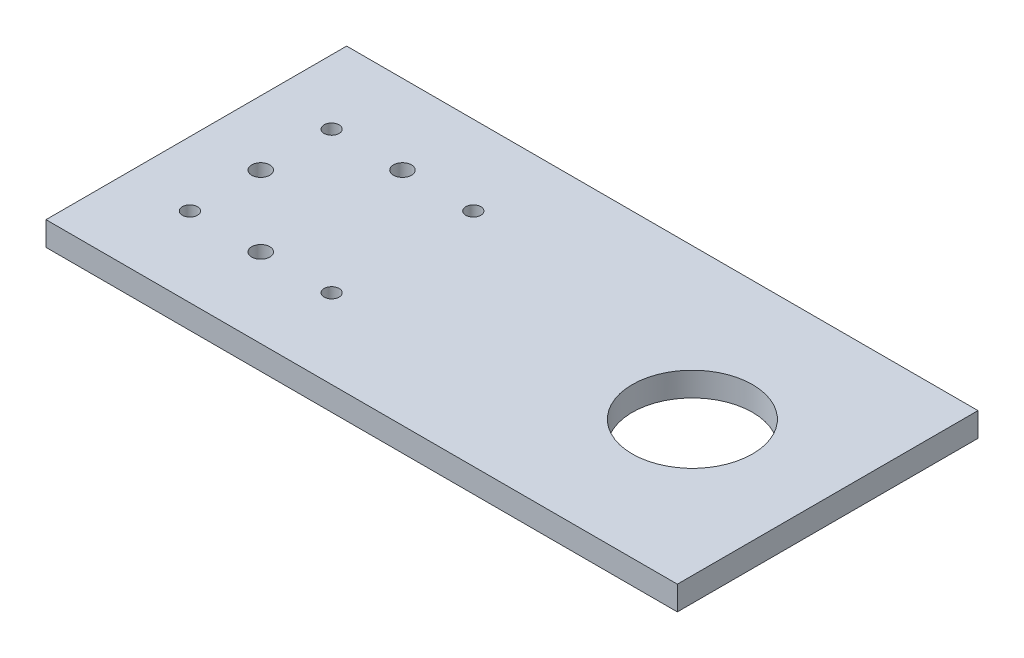
ISO-10303-21;
HEADER;
FILE_DESCRIPTION(('STEP AP214'),'2;1');
FILE_NAME('part.step','',(''),(''),'','','');
FILE_SCHEMA(('AUTOMOTIVE_DESIGN { 1 0 10303 214 1 1 1 1 }'));
ENDSEC;
DATA;
#1=APPLICATION_CONTEXT('core data for automotive mechanical design processes');
#2=APPLICATION_PROTOCOL_DEFINITION('international standard','automotive_design',2000,#1);
#3=PRODUCT_CONTEXT('',#1,'mechanical');
#4=PRODUCT('Part','Part','',(#3));
#5=PRODUCT_RELATED_PRODUCT_CATEGORY('part','',(#4));
#6=PRODUCT_DEFINITION_FORMATION('','',#4);
#7=PRODUCT_DEFINITION_CONTEXT('part definition',#1,'design');
#8=PRODUCT_DEFINITION('design','',#6,#7);
#9=PRODUCT_DEFINITION_SHAPE('','',#8);
#10=(LENGTH_UNIT() NAMED_UNIT(*) SI_UNIT(.MILLI.,.METRE.));
#11=(NAMED_UNIT(*) PLANE_ANGLE_UNIT() SI_UNIT($,.RADIAN.));
#12=(NAMED_UNIT(*) SI_UNIT($,.STERADIAN.) SOLID_ANGLE_UNIT());
#13=UNCERTAINTY_MEASURE_WITH_UNIT(LENGTH_MEASURE(1.E-05),#10,'distance_accuracy_value','');
#14=(GEOMETRIC_REPRESENTATION_CONTEXT(3) GLOBAL_UNCERTAINTY_ASSIGNED_CONTEXT((#13)) GLOBAL_UNIT_ASSIGNED_CONTEXT((#10,
#11,#12)) REPRESENTATION_CONTEXT('',''));
#15=CARTESIAN_POINT('',(0.,0.,0.));
#16=DIRECTION('',(0.,0.,1.));
#17=DIRECTION('',(1.,0.,0.));
#18=AXIS2_PLACEMENT_3D('',#15,#16,#17);
#19=CARTESIAN_POINT('',(-125.,8.,-50.));
#20=DIRECTION('',(0.,0.,1.));
#21=DIRECTION('',(1.,0.,0.));
#22=AXIS2_PLACEMENT_3D('',#19,#20,#21);
#23=PLANE('',#22);
#24=DIRECTION('',(0.,-1.,0.));
#25=VECTOR('',#24,1.);
#26=CARTESIAN_POINT('',(85.,10.,-50.));
#27=LINE('',#26,#25);
#28=CARTESIAN_POINT('',(85.,8.,-50.));
#29=VERTEX_POINT('',#28);
#30=CARTESIAN_POINT('',(85.,0.,-50.));
#31=VERTEX_POINT('',#30);
#32=EDGE_CURVE('E166',#29,#31,#27,.T.);
#33=ORIENTED_EDGE('',*,*,#32,.T.);
#34=DIRECTION('',(-1.,0.,0.));
#35=VECTOR('',#34,1.);
#36=CARTESIAN_POINT('',(-125.,0.,-50.));
#37=LINE('',#36,#35);
#38=CARTESIAN_POINT('',(-125.,0.,-50.));
#39=VERTEX_POINT('',#38);
#40=EDGE_CURVE('E85',#31,#39,#37,.T.);
#41=ORIENTED_EDGE('',*,*,#40,.T.);
#42=DIRECTION('',(0.,-1.,0.));
#43=VECTOR('',#42,1.);
#44=CARTESIAN_POINT('',(-125.,8.,-50.));
#45=LINE('',#44,#43);
#46=CARTESIAN_POINT('',(-125.,8.,-50.));
#47=VERTEX_POINT('',#46);
#48=EDGE_CURVE('E11',#47,#39,#45,.T.);
#49=ORIENTED_EDGE('',*,*,#48,.F.);
#50=DIRECTION('',(-1.,0.,0.));
#51=VECTOR('',#50,1.);
#52=CARTESIAN_POINT('',(-125.,8.,-50.));
#53=LINE('',#52,#51);
#54=EDGE_CURVE('E95',#29,#47,#53,.T.);
#55=ORIENTED_EDGE('',*,*,#54,.F.);
#56=EDGE_LOOP('',(#33,#41,#49,#55));
#57=FACE_BOUND('',#56,.T.);
#58=ADVANCED_FACE('F39',(#57),#23,.F.);
#59=CARTESIAN_POINT('',(-125.,8.,50.));
#60=DIRECTION('',(0.,0.,-1.));
#61=DIRECTION('',(-1.,0.,0.));
#62=AXIS2_PLACEMENT_3D('',#59,#60,#61);
#63=PLANE('',#62);
#64=DIRECTION('',(0.,-1.,0.));
#65=VECTOR('',#64,1.);
#66=CARTESIAN_POINT('',(85.,10.,50.));
#67=LINE('',#66,#65);
#68=CARTESIAN_POINT('',(85.,8.,50.));
#69=VERTEX_POINT('',#68);
#70=CARTESIAN_POINT('',(85.,0.,50.));
#71=VERTEX_POINT('',#70);
#72=EDGE_CURVE('E54',#69,#71,#67,.T.);
#73=ORIENTED_EDGE('',*,*,#72,.F.);
#74=DIRECTION('',(1.,0.,0.));
#75=VECTOR('',#74,1.);
#76=CARTESIAN_POINT('',(-125.,8.,50.));
#77=LINE('',#76,#75);
#78=CARTESIAN_POINT('',(-125.,8.,50.));
#79=VERTEX_POINT('',#78);
#80=EDGE_CURVE('E90',#79,#69,#77,.T.);
#81=ORIENTED_EDGE('',*,*,#80,.F.);
#82=DIRECTION('',(0.,-1.,0.));
#83=VECTOR('',#82,1.);
#84=CARTESIAN_POINT('',(-125.,8.,50.));
#85=LINE('',#84,#83);
#86=CARTESIAN_POINT('',(-125.,0.,50.));
#87=VERTEX_POINT('',#86);
#88=EDGE_CURVE('E47',#79,#87,#85,.T.);
#89=ORIENTED_EDGE('',*,*,#88,.T.);
#90=DIRECTION('',(1.,0.,0.));
#91=VECTOR('',#90,1.);
#92=CARTESIAN_POINT('',(-125.,0.,50.));
#93=LINE('',#92,#91);
#94=EDGE_CURVE('E84',#87,#71,#93,.T.);
#95=ORIENTED_EDGE('',*,*,#94,.T.);
#96=EDGE_LOOP('',(#73,#81,#89,#95));
#97=FACE_BOUND('',#96,.T.);
#98=ADVANCED_FACE('F89',(#97),#63,.F.);
#99=CARTESIAN_POINT('',(0.,8.,0.));
#100=DIRECTION('',(0.,1.,0.));
#101=DIRECTION('',(0.,0.,1.));
#102=AXIS2_PLACEMENT_3D('',#99,#100,#101);
#103=PLANE('',#102);
#104=CARTESIAN_POINT('',(40.,8.,0.));
#105=DIRECTION('',(0.,1.,0.));
#106=DIRECTION('',(0.,0.,1.));
#107=AXIS2_PLACEMENT_3D('',#104,#105,#106);
#108=CIRCLE('',#107,20.);
#109=CARTESIAN_POINT('',(40.,8.,20.));
#110=VERTEX_POINT('',#109);
#111=EDGE_CURVE('E174',#110,#110,#108,.F.);
#112=ORIENTED_EDGE('',*,*,#111,.T.);
#113=EDGE_LOOP('',(#112));
#114=FACE_BOUND('',#113,.T.);
#115=CARTESIAN_POINT('',(-80.,8.,23.57));
#116=DIRECTION('',(0.,1.,0.));
#117=DIRECTION('',(0.,0.,1.));
#118=AXIS2_PLACEMENT_3D('',#115,#116,#117);
#119=CIRCLE('',#118,3.00000000000001);
#120=CARTESIAN_POINT('',(-80.,8.,26.57));
#121=VERTEX_POINT('',#120);
#122=EDGE_CURVE('E153',#121,#121,#119,.T.);
#123=ORIENTED_EDGE('',*,*,#122,.F.);
#124=EDGE_LOOP('',(#123));
#125=FACE_BOUND('',#124,.T.);
#126=CARTESIAN_POINT('',(-80.,8.,-23.57));
#127=DIRECTION('',(0.,1.,0.));
#128=DIRECTION('',(0.,0.,1.));
#129=AXIS2_PLACEMENT_3D('',#126,#127,#128);
#130=CIRCLE('',#129,3.00000000000001);
#131=CARTESIAN_POINT('',(-80.,8.,-20.57));
#132=VERTEX_POINT('',#131);
#133=EDGE_CURVE('E149',#132,#132,#130,.T.);
#134=ORIENTED_EDGE('',*,*,#133,.F.);
#135=EDGE_LOOP('',(#134));
#136=FACE_BOUND('',#135,.T.);
#137=CARTESIAN_POINT('',(-103.57,8.,0.));
#138=DIRECTION('',(0.,1.,0.));
#139=DIRECTION('',(0.,0.,1.));
#140=AXIS2_PLACEMENT_3D('',#137,#138,#139);
#141=CIRCLE('',#140,3.00000000000001);
#142=CARTESIAN_POINT('',(-103.57,8.,3.));
#143=VERTEX_POINT('',#142);
#144=EDGE_CURVE('E139',#143,#143,#141,.T.);
#145=ORIENTED_EDGE('',*,*,#144,.F.);
#146=EDGE_LOOP('',(#145));
#147=FACE_BOUND('',#146,.T.);
#148=CARTESIAN_POINT('',(-103.57,8.,23.57));
#149=DIRECTION('',(0.,1.,0.));
#150=DIRECTION('',(0.,0.,1.));
#151=AXIS2_PLACEMENT_3D('',#148,#149,#150);
#152=CIRCLE('',#151,2.49999999999999);
#153=CARTESIAN_POINT('',(-103.57,8.,26.07));
#154=VERTEX_POINT('',#153);
#155=EDGE_CURVE('E115',#154,#154,#152,.T.);
#156=ORIENTED_EDGE('',*,*,#155,.F.);
#157=EDGE_LOOP('',(#156));
#158=FACE_BOUND('',#157,.T.);
#159=CARTESIAN_POINT('',(-56.43,8.,23.57));
#160=DIRECTION('',(0.,1.,0.));
#161=DIRECTION('',(0.,0.,1.));
#162=AXIS2_PLACEMENT_3D('',#159,#160,#161);
#163=CIRCLE('',#162,2.5);
#164=CARTESIAN_POINT('',(-56.43,8.,26.07));
#165=VERTEX_POINT('',#164);
#166=EDGE_CURVE('E125',#165,#165,#163,.T.);
#167=ORIENTED_EDGE('',*,*,#166,.F.);
#168=EDGE_LOOP('',(#167));
#169=FACE_BOUND('',#168,.T.);
#170=CARTESIAN_POINT('',(-56.43,8.,-23.57));
#171=DIRECTION('',(0.,1.,0.));
#172=DIRECTION('',(0.,0.,1.));
#173=AXIS2_PLACEMENT_3D('',#170,#171,#172);
#174=CIRCLE('',#173,2.5);
#175=CARTESIAN_POINT('',(-56.43,8.,-21.07));
#176=VERTEX_POINT('',#175);
#177=EDGE_CURVE('E114',#176,#176,#174,.T.);
#178=ORIENTED_EDGE('',*,*,#177,.F.);
#179=EDGE_LOOP('',(#178));
#180=FACE_BOUND('',#179,.T.);
#181=CARTESIAN_POINT('',(-103.57,8.,-23.57));
#182=DIRECTION('',(0.,1.,0.));
#183=DIRECTION('',(0.,0.,1.));
#184=AXIS2_PLACEMENT_3D('',#181,#182,#183);
#185=CIRCLE('',#184,2.49999999999999);
#186=CARTESIAN_POINT('',(-103.57,8.,-21.07));
#187=VERTEX_POINT('',#186);
#188=EDGE_CURVE('E110',#187,#187,#185,.T.);
#189=ORIENTED_EDGE('',*,*,#188,.F.);
#190=EDGE_LOOP('',(#189));
#191=FACE_BOUND('',#190,.T.);
#192=ORIENTED_EDGE('',*,*,#80,.T.);
#193=DIRECTION('',(0.,0.,-1.));
#194=VECTOR('',#193,1.);
#195=CARTESIAN_POINT('',(85.,8.,0.));
#196=LINE('',#195,#194);
#197=EDGE_CURVE('E148',#69,#29,#196,.T.);
#198=ORIENTED_EDGE('',*,*,#197,.T.);
#199=ORIENTED_EDGE('',*,*,#54,.T.);
#200=DIRECTION('',(0.,0.,1.));
#201=VECTOR('',#200,1.);
#202=CARTESIAN_POINT('',(-125.,8.,-50.));
#203=LINE('',#202,#201);
#204=EDGE_CURVE('E63',#47,#79,#203,.T.);
#205=ORIENTED_EDGE('',*,*,#204,.T.);
#206=EDGE_LOOP('',(#192,#198,#199,#205));
#207=FACE_BOUND('',#206,.T.);
#208=ADVANCED_FACE('F188',(#114,#125,#136,#147,#158,#169,#180,#191,#207),#103,.T.);
#209=CARTESIAN_POINT('',(0.,0.,0.));
#210=DIRECTION('',(0.,1.,0.));
#211=DIRECTION('',(0.,0.,1.));
#212=AXIS2_PLACEMENT_3D('',#209,#210,#211);
#213=PLANE('',#212);
#214=CARTESIAN_POINT('',(40.,0.,0.));
#215=DIRECTION('',(0.,-1.,0.));
#216=DIRECTION('',(0.,0.,-1.));
#217=AXIS2_PLACEMENT_3D('',#214,#215,#216);
#218=CIRCLE('',#217,20.);
#219=CARTESIAN_POINT('',(40.,0.,-20.));
#220=VERTEX_POINT('',#219);
#221=EDGE_CURVE('E178',#220,#220,#218,.T.);
#222=ORIENTED_EDGE('',*,*,#221,.F.);
#223=EDGE_LOOP('',(#222));
#224=FACE_BOUND('',#223,.T.);
#225=CARTESIAN_POINT('',(-103.57,0.,-23.57));
#226=DIRECTION('',(0.,1.,0.));
#227=DIRECTION('',(0.,0.,1.));
#228=AXIS2_PLACEMENT_3D('',#225,#226,#227);
#229=CIRCLE('',#228,2.49999999999999);
#230=CARTESIAN_POINT('',(-103.57,0.,-21.07));
#231=VERTEX_POINT('',#230);
#232=EDGE_CURVE('E102',#231,#231,#229,.F.);
#233=ORIENTED_EDGE('',*,*,#232,.F.);
#234=EDGE_LOOP('',(#233));
#235=FACE_BOUND('',#234,.T.);
#236=CARTESIAN_POINT('',(-56.43,0.,-23.57));
#237=DIRECTION('',(0.,1.,0.));
#238=DIRECTION('',(0.,0.,1.));
#239=AXIS2_PLACEMENT_3D('',#236,#237,#238);
#240=CIRCLE('',#239,2.5);
#241=CARTESIAN_POINT('',(-56.43,0.,-21.07));
#242=VERTEX_POINT('',#241);
#243=EDGE_CURVE('E129',#242,#242,#240,.F.);
#244=ORIENTED_EDGE('',*,*,#243,.F.);
#245=EDGE_LOOP('',(#244));
#246=FACE_BOUND('',#245,.T.);
#247=CARTESIAN_POINT('',(-56.43,0.,23.57));
#248=DIRECTION('',(0.,1.,0.));
#249=DIRECTION('',(0.,0.,1.));
#250=AXIS2_PLACEMENT_3D('',#247,#248,#249);
#251=CIRCLE('',#250,2.5);
#252=CARTESIAN_POINT('',(-56.43,0.,26.07));
#253=VERTEX_POINT('',#252);
#254=EDGE_CURVE('E119',#253,#253,#251,.F.);
#255=ORIENTED_EDGE('',*,*,#254,.F.);
#256=EDGE_LOOP('',(#255));
#257=FACE_BOUND('',#256,.T.);
#258=CARTESIAN_POINT('',(-103.57,0.,23.57));
#259=DIRECTION('',(0.,1.,0.));
#260=DIRECTION('',(0.,0.,1.));
#261=AXIS2_PLACEMENT_3D('',#258,#259,#260);
#262=CIRCLE('',#261,2.49999999999999);
#263=CARTESIAN_POINT('',(-103.57,0.,26.07));
#264=VERTEX_POINT('',#263);
#265=EDGE_CURVE('E120',#264,#264,#262,.F.);
#266=ORIENTED_EDGE('',*,*,#265,.F.);
#267=EDGE_LOOP('',(#266));
#268=FACE_BOUND('',#267,.T.);
#269=CARTESIAN_POINT('',(-103.57,0.,0.));
#270=DIRECTION('',(0.,1.,0.));
#271=DIRECTION('',(0.,0.,1.));
#272=AXIS2_PLACEMENT_3D('',#269,#270,#271);
#273=CIRCLE('',#272,3.00000000000001);
#274=CARTESIAN_POINT('',(-103.57,0.,3.));
#275=VERTEX_POINT('',#274);
#276=EDGE_CURVE('E144',#275,#275,#273,.F.);
#277=ORIENTED_EDGE('',*,*,#276,.F.);
#278=EDGE_LOOP('',(#277));
#279=FACE_BOUND('',#278,.T.);
#280=CARTESIAN_POINT('',(-80.,0.,-23.57));
#281=DIRECTION('',(0.,1.,0.));
#282=DIRECTION('',(0.,0.,1.));
#283=AXIS2_PLACEMENT_3D('',#280,#281,#282);
#284=CIRCLE('',#283,3.00000000000001);
#285=CARTESIAN_POINT('',(-80.,0.,-20.57));
#286=VERTEX_POINT('',#285);
#287=EDGE_CURVE('E143',#286,#286,#284,.F.);
#288=ORIENTED_EDGE('',*,*,#287,.F.);
#289=EDGE_LOOP('',(#288));
#290=FACE_BOUND('',#289,.T.);
#291=CARTESIAN_POINT('',(-80.,0.,23.57));
#292=DIRECTION('',(0.,1.,0.));
#293=DIRECTION('',(0.,0.,1.));
#294=AXIS2_PLACEMENT_3D('',#291,#292,#293);
#295=CIRCLE('',#294,3.00000000000001);
#296=CARTESIAN_POINT('',(-80.,0.,26.57));
#297=VERTEX_POINT('',#296);
#298=EDGE_CURVE('E124',#297,#297,#295,.F.);
#299=ORIENTED_EDGE('',*,*,#298,.F.);
#300=EDGE_LOOP('',(#299));
#301=FACE_BOUND('',#300,.T.);
#302=DIRECTION('',(0.,0.,1.));
#303=VECTOR('',#302,1.);
#304=CARTESIAN_POINT('',(85.,0.,-50.));
#305=LINE('',#304,#303);
#306=EDGE_CURVE('E93',#31,#71,#305,.T.);
#307=ORIENTED_EDGE('',*,*,#306,.T.);
#308=ORIENTED_EDGE('',*,*,#94,.F.);
#309=DIRECTION('',(0.,0.,1.));
#310=VECTOR('',#309,1.);
#311=CARTESIAN_POINT('',(-125.,0.,-50.));
#312=LINE('',#311,#310);
#313=EDGE_CURVE('E75',#39,#87,#312,.T.);
#314=ORIENTED_EDGE('',*,*,#313,.F.);
#315=ORIENTED_EDGE('',*,*,#40,.F.);
#316=EDGE_LOOP('',(#307,#308,#314,#315));
#317=FACE_BOUND('',#316,.T.);
#318=ADVANCED_FACE('F92',(#224,#235,#246,#257,#268,#279,#290,#301,#317),#213,.F.);
#319=CARTESIAN_POINT('',(-125.,8.,-50.));
#320=DIRECTION('',(1.,0.,0.));
#321=DIRECTION('',(0.,0.,-1.));
#322=AXIS2_PLACEMENT_3D('',#319,#320,#321);
#323=PLANE('',#322);
#324=ORIENTED_EDGE('',*,*,#313,.T.);
#325=ORIENTED_EDGE('',*,*,#88,.F.);
#326=ORIENTED_EDGE('',*,*,#204,.F.);
#327=ORIENTED_EDGE('',*,*,#48,.T.);
#328=EDGE_LOOP('',(#324,#325,#326,#327));
#329=FACE_BOUND('',#328,.T.);
#330=ADVANCED_FACE('F77',(#329),#323,.F.);
#331=CARTESIAN_POINT('',(-103.57,-7.07106781186548,-23.57));
#332=DIRECTION('',(0.,1.,0.));
#333=DIRECTION('',(0.,0.,1.));
#334=AXIS2_PLACEMENT_3D('',#331,#332,#333);
#335=CYLINDRICAL_SURFACE('',#334,2.49999999999999);
#336=ORIENTED_EDGE('',*,*,#232,.T.);
#337=EDGE_LOOP('',(#336));
#338=FACE_BOUND('',#337,.T.);
#339=ORIENTED_EDGE('',*,*,#188,.T.);
#340=EDGE_LOOP('',(#339));
#341=FACE_BOUND('',#340,.T.);
#342=ADVANCED_FACE('F242',(#338,#341),#335,.F.);
#343=CARTESIAN_POINT('',(-56.43,-7.07106781186548,-23.57));
#344=DIRECTION('',(0.,1.,0.));
#345=DIRECTION('',(0.,0.,1.));
#346=AXIS2_PLACEMENT_3D('',#343,#344,#345);
#347=CYLINDRICAL_SURFACE('',#346,2.5);
#348=ORIENTED_EDGE('',*,*,#243,.T.);
#349=EDGE_LOOP('',(#348));
#350=FACE_BOUND('',#349,.T.);
#351=ORIENTED_EDGE('',*,*,#177,.T.);
#352=EDGE_LOOP('',(#351));
#353=FACE_BOUND('',#352,.T.);
#354=ADVANCED_FACE('F246',(#350,#353),#347,.F.);
#355=CARTESIAN_POINT('',(-56.43,-7.07106781186548,23.57));
#356=DIRECTION('',(0.,1.,0.));
#357=DIRECTION('',(0.,0.,1.));
#358=AXIS2_PLACEMENT_3D('',#355,#356,#357);
#359=CYLINDRICAL_SURFACE('',#358,2.5);
#360=ORIENTED_EDGE('',*,*,#254,.T.);
#361=EDGE_LOOP('',(#360));
#362=FACE_BOUND('',#361,.T.);
#363=ORIENTED_EDGE('',*,*,#166,.T.);
#364=EDGE_LOOP('',(#363));
#365=FACE_BOUND('',#364,.T.);
#366=ADVANCED_FACE('F252',(#362,#365),#359,.F.);
#367=CARTESIAN_POINT('',(-103.57,-7.07106781186548,23.57));
#368=DIRECTION('',(0.,1.,0.));
#369=DIRECTION('',(0.,0.,1.));
#370=AXIS2_PLACEMENT_3D('',#367,#368,#369);
#371=CYLINDRICAL_SURFACE('',#370,2.49999999999999);
#372=ORIENTED_EDGE('',*,*,#265,.T.);
#373=EDGE_LOOP('',(#372));
#374=FACE_BOUND('',#373,.T.);
#375=ORIENTED_EDGE('',*,*,#155,.T.);
#376=EDGE_LOOP('',(#375));
#377=FACE_BOUND('',#376,.T.);
#378=ADVANCED_FACE('F257',(#374,#377),#371,.F.);
#379=CARTESIAN_POINT('',(-103.57,-8.48528137423859,0.));
#380=DIRECTION('',(0.,1.,0.));
#381=DIRECTION('',(0.,0.,1.));
#382=AXIS2_PLACEMENT_3D('',#379,#380,#381);
#383=CYLINDRICAL_SURFACE('',#382,3.00000000000001);
#384=ORIENTED_EDGE('',*,*,#276,.T.);
#385=EDGE_LOOP('',(#384));
#386=FACE_BOUND('',#385,.T.);
#387=ORIENTED_EDGE('',*,*,#144,.T.);
#388=EDGE_LOOP('',(#387));
#389=FACE_BOUND('',#388,.T.);
#390=ADVANCED_FACE('F260',(#386,#389),#383,.F.);
#391=CARTESIAN_POINT('',(-80.,-8.48528137423859,-23.57));
#392=DIRECTION('',(0.,1.,0.));
#393=DIRECTION('',(0.,0.,1.));
#394=AXIS2_PLACEMENT_3D('',#391,#392,#393);
#395=CYLINDRICAL_SURFACE('',#394,3.00000000000001);
#396=ORIENTED_EDGE('',*,*,#287,.T.);
#397=EDGE_LOOP('',(#396));
#398=FACE_BOUND('',#397,.T.);
#399=ORIENTED_EDGE('',*,*,#133,.T.);
#400=EDGE_LOOP('',(#399));
#401=FACE_BOUND('',#400,.T.);
#402=ADVANCED_FACE('F208',(#398,#401),#395,.F.);
#403=CARTESIAN_POINT('',(-80.,-8.48528137423859,23.57));
#404=DIRECTION('',(0.,1.,0.));
#405=DIRECTION('',(0.,0.,1.));
#406=AXIS2_PLACEMENT_3D('',#403,#404,#405);
#407=CYLINDRICAL_SURFACE('',#406,3.00000000000001);
#408=ORIENTED_EDGE('',*,*,#298,.T.);
#409=EDGE_LOOP('',(#408));
#410=FACE_BOUND('',#409,.T.);
#411=ORIENTED_EDGE('',*,*,#122,.T.);
#412=EDGE_LOOP('',(#411));
#413=FACE_BOUND('',#412,.T.);
#414=ADVANCED_FACE('F204',(#410,#413),#407,.F.);
#415=CARTESIAN_POINT('',(85.,10.,-50.));
#416=DIRECTION('',(1.,0.,0.));
#417=DIRECTION('',(0.,0.,-1.));
#418=AXIS2_PLACEMENT_3D('',#415,#416,#417);
#419=PLANE('',#418);
#420=ORIENTED_EDGE('',*,*,#72,.T.);
#421=ORIENTED_EDGE('',*,*,#306,.F.);
#422=ORIENTED_EDGE('',*,*,#32,.F.);
#423=ORIENTED_EDGE('',*,*,#197,.F.);
#424=EDGE_LOOP('',(#420,#421,#422,#423));
#425=FACE_BOUND('',#424,.T.);
#426=ADVANCED_FACE('F207',(#425),#419,.T.);
#427=CARTESIAN_POINT('',(40.,64.5685424949238,0.));
#428=DIRECTION('',(0.,-1.,0.));
#429=DIRECTION('',(0.,0.,-1.));
#430=AXIS2_PLACEMENT_3D('',#427,#428,#429);
#431=CYLINDRICAL_SURFACE('',#430,20.);
#432=ORIENTED_EDGE('',*,*,#221,.T.);
#433=EDGE_LOOP('',(#432));
#434=FACE_BOUND('',#433,.T.);
#435=ORIENTED_EDGE('',*,*,#111,.F.);
#436=EDGE_LOOP('',(#435));
#437=FACE_BOUND('',#436,.T.);
#438=ADVANCED_FACE('F183',(#434,#437),#431,.F.);
#439=CLOSED_SHELL('',(#58,#98,#208,#318,#330,#342,#354,#366,#378,#390,#402,#414,#426,#438));
#440=MANIFOLD_SOLID_BREP('B2',#439);
#441=ADVANCED_BREP_SHAPE_REPRESENTATION('',(#18,#440),#14);
#442=SHAPE_DEFINITION_REPRESENTATION(#9,#441);
ENDSEC;
END-ISO-10303-21;
